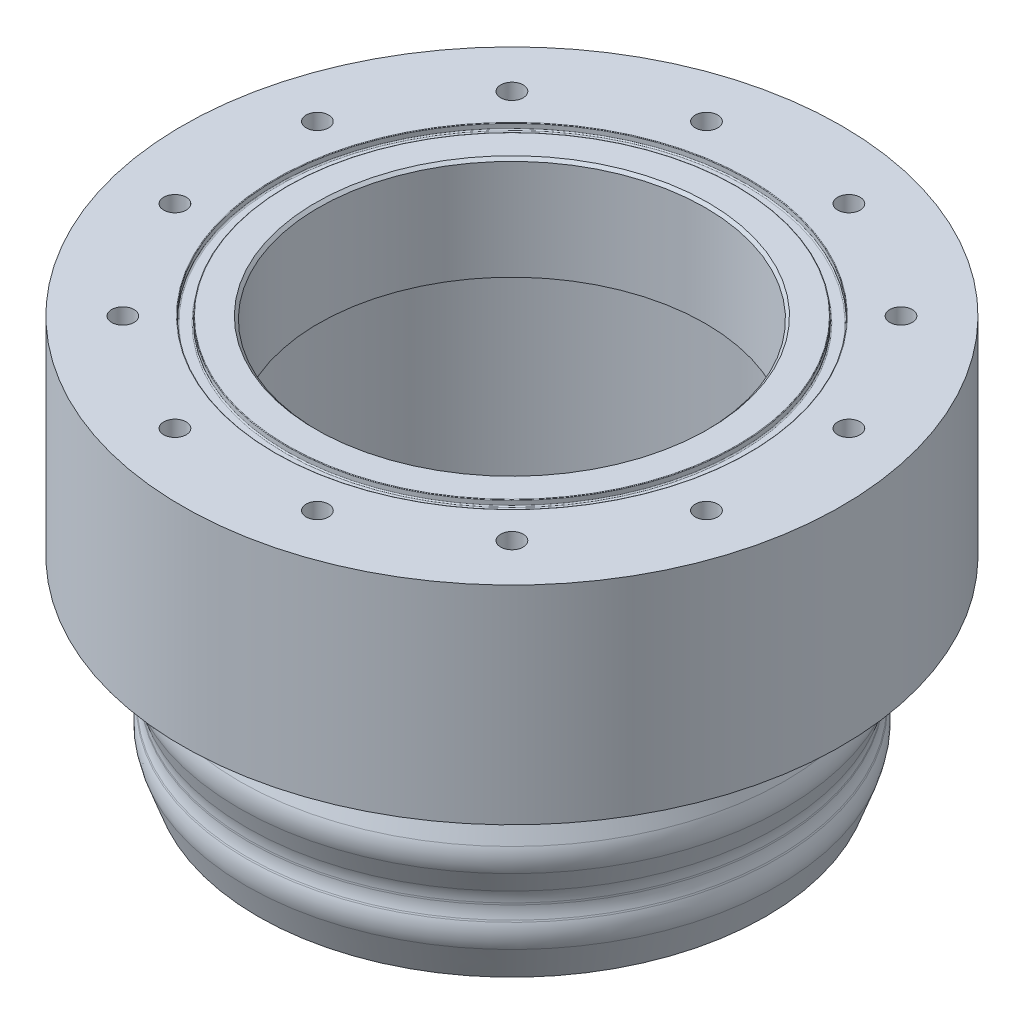
ISO-10303-21;
HEADER;
FILE_DESCRIPTION(('STEP AP214'),'2;1');
FILE_NAME('part.step','',(''),(''),'','','');
FILE_SCHEMA(('AUTOMOTIVE_DESIGN { 1 0 10303 214 1 1 1 1 }'));
ENDSEC;
DATA;
#1=APPLICATION_CONTEXT('core data for automotive mechanical design processes');
#2=APPLICATION_PROTOCOL_DEFINITION('international standard','automotive_design',2000,#1);
#3=PRODUCT_CONTEXT('',#1,'mechanical');
#4=PRODUCT('Part','Part','',(#3));
#5=PRODUCT_RELATED_PRODUCT_CATEGORY('part','',(#4));
#6=PRODUCT_DEFINITION_FORMATION('','',#4);
#7=PRODUCT_DEFINITION_CONTEXT('part definition',#1,'design');
#8=PRODUCT_DEFINITION('design','',#6,#7);
#9=PRODUCT_DEFINITION_SHAPE('','',#8);
#10=(LENGTH_UNIT() NAMED_UNIT(*) SI_UNIT(.MILLI.,.METRE.));
#11=(NAMED_UNIT(*) PLANE_ANGLE_UNIT() SI_UNIT($,.RADIAN.));
#12=(NAMED_UNIT(*) SI_UNIT($,.STERADIAN.) SOLID_ANGLE_UNIT());
#13=UNCERTAINTY_MEASURE_WITH_UNIT(LENGTH_MEASURE(1.E-05),#10,'distance_accuracy_value','');
#14=(GEOMETRIC_REPRESENTATION_CONTEXT(3) GLOBAL_UNCERTAINTY_ASSIGNED_CONTEXT((#13)) GLOBAL_UNIT_ASSIGNED_CONTEXT((#10,
#11,#12)) REPRESENTATION_CONTEXT('',''));
#15=CARTESIAN_POINT('',(0.,0.,0.));
#16=DIRECTION('',(0.,0.,1.));
#17=DIRECTION('',(1.,0.,0.));
#18=AXIS2_PLACEMENT_3D('',#15,#16,#17);
#19=CARTESIAN_POINT('',(0.,0.,0.));
#20=DIRECTION('',(0.,-1.,0.));
#21=DIRECTION('',(0.,0.,-1.));
#22=AXIS2_PLACEMENT_3D('',#19,#20,#21);
#23=CYLINDRICAL_SURFACE('',#22,73.025);
#24=CARTESIAN_POINT('',(0.,-23.15125433516,0.));
#25=DIRECTION('',(0.,-1.,0.));
#26=DIRECTION('',(0.,0.,-1.));
#27=AXIS2_PLACEMENT_3D('',#24,#25,#26);
#28=CIRCLE('',#27,73.025);
#29=CARTESIAN_POINT('',(0.,-23.15125433516,-73.025));
#30=VERTEX_POINT('',#29);
#31=EDGE_CURVE('E92',#30,#30,#28,.T.);
#32=ORIENTED_EDGE('',*,*,#31,.F.);
#33=EDGE_LOOP('',(#32));
#34=FACE_BOUND('',#33,.T.);
#35=CARTESIAN_POINT('',(0.,22.86,0.));
#36=DIRECTION('',(0.,-1.,0.));
#37=DIRECTION('',(0.,0.,-1.));
#38=AXIS2_PLACEMENT_3D('',#35,#36,#37);
#39=CIRCLE('',#38,73.025);
#40=CARTESIAN_POINT('',(0.,22.86,-73.025));
#41=VERTEX_POINT('',#40);
#42=EDGE_CURVE('E128',#41,#41,#39,.T.);
#43=ORIENTED_EDGE('',*,*,#42,.T.);
#44=EDGE_LOOP('',(#43));
#45=FACE_BOUND('',#44,.T.);
#46=ADVANCED_FACE('F36',(#34,#45),#23,.T.);
#47=CARTESIAN_POINT('',(-73.025,-23.15125433516,0.));
#48=DIRECTION('',(0.,1.,0.));
#49=DIRECTION('',(0.,0.,1.));
#50=AXIS2_PLACEMENT_3D('',#47,#48,#49);
#51=PLANE('',#50);
#52=CARTESIAN_POINT('',(0.,-23.15125433516,0.));
#53=DIRECTION('',(0.,1.,0.));
#54=DIRECTION('',(0.,0.,1.));
#55=AXIS2_PLACEMENT_3D('',#52,#53,#54);
#56=CIRCLE('',#55,60.8076);
#57=CARTESIAN_POINT('',(0.,-23.15125433516,60.8076));
#58=VERTEX_POINT('',#57);
#59=EDGE_CURVE('E74',#58,#58,#56,.T.);
#60=ORIENTED_EDGE('',*,*,#59,.T.);
#61=EDGE_LOOP('',(#60));
#62=FACE_BOUND('',#61,.T.);
#63=ORIENTED_EDGE('',*,*,#31,.T.);
#64=EDGE_LOOP('',(#63));
#65=FACE_BOUND('',#64,.T.);
#66=ADVANCED_FACE('F296',(#62,#65),#51,.F.);
#67=CARTESIAN_POINT('',(0.,0.,0.));
#68=DIRECTION('',(0.,-1.,0.));
#69=DIRECTION('',(0.,0.,-1.));
#70=AXIS2_PLACEMENT_3D('',#67,#68,#69);
#71=CYLINDRICAL_SURFACE('',#70,58.2676);
#72=CARTESIAN_POINT('',(0.,-29.1440772325038,0.));
#73=DIRECTION('',(0.,-1.,0.));
#74=DIRECTION('',(0.,0.,-1.));
#75=AXIS2_PLACEMENT_3D('',#72,#73,#74);
#76=CIRCLE('',#75,58.2676);
#77=CARTESIAN_POINT('',(0.,-29.1440772325038,-58.2676));
#78=VERTEX_POINT('',#77);
#79=EDGE_CURVE('E47',#78,#78,#76,.F.);
#80=ORIENTED_EDGE('',*,*,#79,.T.);
#81=EDGE_LOOP('',(#80));
#82=FACE_BOUND('',#81,.T.);
#83=CARTESIAN_POINT('',(0.,-25.69125433516,0.));
#84=DIRECTION('',(0.,1.,0.));
#85=DIRECTION('',(0.,0.,1.));
#86=AXIS2_PLACEMENT_3D('',#83,#84,#85);
#87=CIRCLE('',#86,58.2676);
#88=CARTESIAN_POINT('',(0.,-25.69125433516,58.2676));
#89=VERTEX_POINT('',#88);
#90=EDGE_CURVE('E77',#89,#89,#87,.F.);
#91=ORIENTED_EDGE('',*,*,#90,.T.);
#92=EDGE_LOOP('',(#91));
#93=FACE_BOUND('',#92,.T.);
#94=ADVANCED_FACE('F302',(#82,#93),#71,.T.);
#95=CARTESIAN_POINT('',(0.,-30.4876888255023,0.));
#96=DIRECTION('',(0.,-1.,0.));
#97=DIRECTION('',(0.,0.,-1.));
#98=AXIS2_PLACEMENT_3D('',#95,#96,#97);
#99=CONICAL_SURFACE('',#98,58.2676,0.349065850398867);
#100=CARTESIAN_POINT('',(0.,-31.7502707246454,0.));
#101=DIRECTION('',(0.,-1.,0.));
#102=DIRECTION('',(0.,0.,-1.));
#103=AXIS2_PLACEMENT_3D('',#100,#101,#102);
#104=CIRCLE('',#103,58.7271422296114);
#105=CARTESIAN_POINT('',(0.,-31.7502707246454,-58.7271422296114));
#106=VERTEX_POINT('',#105);
#107=EDGE_CURVE('E51',#106,#106,#104,.T.);
#108=ORIENTED_EDGE('',*,*,#107,.T.);
#109=EDGE_LOOP('',(#108));
#110=FACE_BOUND('',#109,.T.);
#111=CARTESIAN_POINT('',(0.,-36.2558065078584,0.));
#112=DIRECTION('',(0.,1.,0.));
#113=DIRECTION('',(0.,0.,1.));
#114=AXIS2_PLACEMENT_3D('',#111,#112,#113);
#115=CIRCLE('',#114,60.3670231441222);
#116=CARTESIAN_POINT('',(0.,-36.2558065078584,60.3670231441222));
#117=VERTEX_POINT('',#116);
#118=EDGE_CURVE('E86',#117,#117,#115,.T.);
#119=ORIENTED_EDGE('',*,*,#118,.T.);
#120=EDGE_LOOP('',(#119));
#121=FACE_BOUND('',#120,.T.);
#122=ADVANCED_FACE('F343',(#110,#121),#99,.T.);
#123=CARTESIAN_POINT('',(0.,-38.862,0.));
#124=DIRECTION('',(0.,1.,0.));
#125=DIRECTION('',(0.,0.,1.));
#126=AXIS2_PLACEMENT_3D('',#123,#124,#125);
#127=CONICAL_SURFACE('',#126,61.3156,0.349065850398866);
#128=CARTESIAN_POINT('',(0.,-45.9737292753546,0.));
#129=DIRECTION('',(0.,1.,0.));
#130=DIRECTION('',(0.,0.,1.));
#131=AXIS2_PLACEMENT_3D('',#128,#129,#130);
#132=CIRCLE('',#131,58.7271422296114);
#133=CARTESIAN_POINT('',(0.,-45.9737292753546,58.7271422296114));
#134=VERTEX_POINT('',#133);
#135=EDGE_CURVE('E56',#134,#134,#132,.T.);
#136=ORIENTED_EDGE('',*,*,#135,.T.);
#137=EDGE_LOOP('',(#136));
#138=FACE_BOUND('',#137,.T.);
#139=CARTESIAN_POINT('',(0.,-41.4681934921416,0.));
#140=DIRECTION('',(0.,-1.,0.));
#141=DIRECTION('',(0.,0.,-1.));
#142=AXIS2_PLACEMENT_3D('',#139,#140,#141);
#143=CIRCLE('',#142,60.3670231441222);
#144=CARTESIAN_POINT('',(0.,-41.4681934921416,-60.3670231441222));
#145=VERTEX_POINT('',#144);
#146=EDGE_CURVE('E89',#145,#145,#143,.T.);
#147=ORIENTED_EDGE('',*,*,#146,.T.);
#148=EDGE_LOOP('',(#147));
#149=FACE_BOUND('',#148,.T.);
#150=ADVANCED_FACE('F346',(#138,#149),#127,.T.);
#151=CARTESIAN_POINT('',(0.,0.,0.));
#152=DIRECTION('',(0.,-1.,0.));
#153=DIRECTION('',(0.,0.,-1.));
#154=AXIS2_PLACEMENT_3D('',#151,#152,#153);
#155=CYLINDRICAL_SURFACE('',#154,58.2676);
#156=CARTESIAN_POINT('',(0.,-48.9660995814992,0.));
#157=DIRECTION('',(0.,-1.,0.));
#158=DIRECTION('',(0.,0.,-1.));
#159=AXIS2_PLACEMENT_3D('',#156,#157,#158);
#160=CIRCLE('',#159,58.2676);
#161=CARTESIAN_POINT('',(0.,-48.9660995814992,-58.2676));
#162=VERTEX_POINT('',#161);
#163=EDGE_CURVE('E59',#162,#162,#160,.F.);
#164=ORIENTED_EDGE('',*,*,#163,.T.);
#165=EDGE_LOOP('',(#164));
#166=FACE_BOUND('',#165,.T.);
#167=CARTESIAN_POINT('',(0.,-48.5799227674962,0.));
#168=DIRECTION('',(0.,-1.,0.));
#169=DIRECTION('',(0.,0.,-1.));
#170=AXIS2_PLACEMENT_3D('',#167,#168,#169);
#171=CIRCLE('',#170,58.2676);
#172=CARTESIAN_POINT('',(0.,-48.5799227674962,-58.2676));
#173=VERTEX_POINT('',#172);
#174=EDGE_CURVE('E62',#173,#173,#171,.T.);
#175=ORIENTED_EDGE('',*,*,#174,.T.);
#176=EDGE_LOOP('',(#175));
#177=FACE_BOUND('',#176,.T.);
#178=ADVANCED_FACE('F353',(#166,#177),#155,.T.);
#179=CARTESIAN_POINT('',(0.,-50.3097111744977,0.));
#180=DIRECTION('',(0.,-1.,0.));
#181=DIRECTION('',(0.,0.,-1.));
#182=AXIS2_PLACEMENT_3D('',#179,#180,#181);
#183=CONICAL_SURFACE('',#182,58.2676,0.349065850398869);
#184=CARTESIAN_POINT('',(0.,-51.5722930736408,0.));
#185=DIRECTION('',(0.,-1.,0.));
#186=DIRECTION('',(0.,0.,-1.));
#187=AXIS2_PLACEMENT_3D('',#184,#185,#186);
#188=CIRCLE('',#187,58.7271422296114);
#189=CARTESIAN_POINT('',(0.,-51.5722930736408,-58.7271422296114));
#190=VERTEX_POINT('',#189);
#191=EDGE_CURVE('E65',#190,#190,#188,.T.);
#192=ORIENTED_EDGE('',*,*,#191,.T.);
#193=EDGE_LOOP('',(#192));
#194=FACE_BOUND('',#193,.T.);
#195=CARTESIAN_POINT('',(0.,-51.8906732696049,0.));
#196=DIRECTION('',(0.,1.,0.));
#197=DIRECTION('',(0.,0.,1.));
#198=AXIS2_PLACEMENT_3D('',#195,#196,#197);
#199=CIRCLE('',#198,58.8430231441222);
#200=CARTESIAN_POINT('',(0.,-51.8906732696049,58.8430231441222));
#201=VERTEX_POINT('',#200);
#202=EDGE_CURVE('E68',#201,#201,#199,.T.);
#203=ORIENTED_EDGE('',*,*,#202,.T.);
#204=EDGE_LOOP('',(#203));
#205=FACE_BOUND('',#204,.T.);
#206=ADVANCED_FACE('F359',(#194,#205),#183,.T.);
#207=CARTESIAN_POINT('',(0.,-54.4968667617465,0.));
#208=DIRECTION('',(0.,1.,0.));
#209=DIRECTION('',(0.,0.,1.));
#210=AXIS2_PLACEMENT_3D('',#207,#208,#209);
#211=CONICAL_SURFACE('',#210,59.7916,0.349065850398868);
#212=CARTESIAN_POINT('',(0.,-57.1030602538881,0.));
#213=DIRECTION('',(0.,-1.,0.));
#214=DIRECTION('',(0.,0.,-1.));
#215=AXIS2_PLACEMENT_3D('',#212,#213,#214);
#216=CIRCLE('',#215,58.8430231441222);
#217=CARTESIAN_POINT('',(0.,-57.1030602538881,-58.8430231441222));
#218=VERTEX_POINT('',#217);
#219=EDGE_CURVE('E71',#218,#218,#216,.T.);
#220=ORIENTED_EDGE('',*,*,#219,.T.);
#221=EDGE_LOOP('',(#220));
#222=FACE_BOUND('',#221,.T.);
#223=CARTESIAN_POINT('',(0.,-64.2668964653271,0.));
#224=DIRECTION('',(0.,-1.,0.));
#225=DIRECTION('',(0.,0.,-1.));
#226=AXIS2_PLACEMENT_3D('',#223,#224,#225);
#227=CIRCLE('',#226,56.2356);
#228=CARTESIAN_POINT('',(0.,-64.2668964653271,-56.2356));
#229=VERTEX_POINT('',#228);
#230=EDGE_CURVE('E95',#229,#229,#227,.T.);
#231=ORIENTED_EDGE('',*,*,#230,.F.);
#232=EDGE_LOOP('',(#231));
#233=FACE_BOUND('',#232,.T.);
#234=ADVANCED_FACE('F396',(#222,#233),#211,.T.);
#235=CARTESIAN_POINT('',(-56.2356,-64.2668964653271,0.));
#236=DIRECTION('',(0.,1.,0.));
#237=DIRECTION('',(0.,0.,1.));
#238=AXIS2_PLACEMENT_3D('',#235,#236,#237);
#239=PLANE('',#238);
#240=CARTESIAN_POINT('',(0.,-64.2668964653271,0.));
#241=DIRECTION('',(0.,-1.,0.));
#242=DIRECTION('',(0.,0.,-1.));
#243=AXIS2_PLACEMENT_3D('',#240,#241,#242);
#244=CIRCLE('',#243,55.7276);
#245=CARTESIAN_POINT('',(0.,-64.2668964653271,-55.7276));
#246=VERTEX_POINT('',#245);
#247=EDGE_CURVE('E98',#246,#246,#244,.T.);
#248=ORIENTED_EDGE('',*,*,#247,.F.);
#249=EDGE_LOOP('',(#248));
#250=FACE_BOUND('',#249,.T.);
#251=ORIENTED_EDGE('',*,*,#230,.T.);
#252=EDGE_LOOP('',(#251));
#253=FACE_BOUND('',#252,.T.);
#254=ADVANCED_FACE('F730',(#250,#253),#239,.F.);
#255=CARTESIAN_POINT('',(0.,0.,0.));
#256=DIRECTION('',(0.,-1.,0.));
#257=DIRECTION('',(0.,0.,-1.));
#258=AXIS2_PLACEMENT_3D('',#255,#256,#257);
#259=CYLINDRICAL_SURFACE('',#258,55.7276);
#260=CARTESIAN_POINT('',(0.,-2.54,0.));
#261=DIRECTION('',(0.,1.,0.));
#262=DIRECTION('',(0.,0.,1.));
#263=AXIS2_PLACEMENT_3D('',#260,#261,#262);
#264=CIRCLE('',#263,55.7276);
#265=CARTESIAN_POINT('',(0.,-2.54,55.7276));
#266=VERTEX_POINT('',#265);
#267=EDGE_CURVE('E80',#266,#266,#264,.T.);
#268=ORIENTED_EDGE('',*,*,#267,.T.);
#269=EDGE_LOOP('',(#268));
#270=FACE_BOUND('',#269,.T.);
#271=ORIENTED_EDGE('',*,*,#247,.T.);
#272=EDGE_LOOP('',(#271));
#273=FACE_BOUND('',#272,.T.);
#274=ADVANCED_FACE('F740',(#270,#273),#259,.F.);
#275=CARTESIAN_POINT('',(-42.8625,0.,0.));
#276=DIRECTION('',(0.,1.,0.));
#277=DIRECTION('',(0.,0.,1.));
#278=AXIS2_PLACEMENT_3D('',#275,#276,#277);
#279=PLANE('',#278);
#280=CARTESIAN_POINT('',(0.,0.,0.));
#281=DIRECTION('',(0.,1.,0.));
#282=DIRECTION('',(0.,0.,1.));
#283=AXIS2_PLACEMENT_3D('',#280,#281,#282);
#284=CIRCLE('',#283,53.1876);
#285=CARTESIAN_POINT('',(0.,0.,53.1876));
#286=VERTEX_POINT('',#285);
#287=EDGE_CURVE('E83',#286,#286,#284,.F.);
#288=ORIENTED_EDGE('',*,*,#287,.T.);
#289=EDGE_LOOP('',(#288));
#290=FACE_BOUND('',#289,.T.);
#291=CARTESIAN_POINT('',(0.,0.,0.));
#292=DIRECTION('',(0.,-1.,0.));
#293=DIRECTION('',(0.,0.,-1.));
#294=AXIS2_PLACEMENT_3D('',#291,#292,#293);
#295=CIRCLE('',#294,42.8625);
#296=CARTESIAN_POINT('',(0.,0.,-42.8625));
#297=VERTEX_POINT('',#296);
#298=EDGE_CURVE('E101',#297,#297,#295,.T.);
#299=ORIENTED_EDGE('',*,*,#298,.F.);
#300=EDGE_LOOP('',(#299));
#301=FACE_BOUND('',#300,.T.);
#302=ADVANCED_FACE('F293',(#290,#301),#279,.F.);
#303=CARTESIAN_POINT('',(0.,0.,0.));
#304=DIRECTION('',(0.,-1.,0.));
#305=DIRECTION('',(0.,0.,-1.));
#306=AXIS2_PLACEMENT_3D('',#303,#304,#305);
#307=CYLINDRICAL_SURFACE('',#306,42.8625);
#308=CARTESIAN_POINT('',(0.,22.225,0.));
#309=DIRECTION('',(0.,-1.,0.));
#310=DIRECTION('',(0.,0.,-1.));
#311=AXIS2_PLACEMENT_3D('',#308,#309,#310);
#312=CIRCLE('',#311,42.8625);
#313=CARTESIAN_POINT('',(0.,22.225,-42.8625));
#314=VERTEX_POINT('',#313);
#315=EDGE_CURVE('E10',#314,#314,#312,.F.);
#316=ORIENTED_EDGE('',*,*,#315,.T.);
#317=EDGE_LOOP('',(#316));
#318=FACE_BOUND('',#317,.T.);
#319=ORIENTED_EDGE('',*,*,#298,.T.);
#320=EDGE_LOOP('',(#319));
#321=FACE_BOUND('',#320,.T.);
#322=ADVANCED_FACE('F288',(#318,#321),#307,.F.);
#323=CARTESIAN_POINT('',(-42.8625,22.86,0.));
#324=DIRECTION('',(0.,-1.,0.));
#325=DIRECTION('',(0.,0.,-1.));
#326=AXIS2_PLACEMENT_3D('',#323,#324,#325);
#327=PLANE('',#326);
#328=CARTESIAN_POINT('',(0.,22.86,0.));
#329=DIRECTION('',(0.,-1.,0.));
#330=DIRECTION('',(0.,0.,-1.));
#331=AXIS2_PLACEMENT_3D('',#328,#329,#330);
#332=CIRCLE('',#331,43.4975);
#333=CARTESIAN_POINT('',(0.,22.86,-43.4975));
#334=VERTEX_POINT('',#333);
#335=EDGE_CURVE('E43',#334,#334,#332,.T.);
#336=ORIENTED_EDGE('',*,*,#335,.T.);
#337=EDGE_LOOP('',(#336));
#338=FACE_BOUND('',#337,.T.);
#339=CARTESIAN_POINT('',(0.,22.86,0.));
#340=DIRECTION('',(0.,-1.,0.));
#341=DIRECTION('',(0.,0.,-1.));
#342=AXIS2_PLACEMENT_3D('',#339,#340,#341);
#343=CIRCLE('',#342,49.7459);
#344=CARTESIAN_POINT('',(0.,22.86,-49.7459));
#345=VERTEX_POINT('',#344);
#346=EDGE_CURVE('E104',#345,#345,#343,.T.);
#347=ORIENTED_EDGE('',*,*,#346,.F.);
#348=EDGE_LOOP('',(#347));
#349=FACE_BOUND('',#348,.T.);
#350=ADVANCED_FACE('F283',(#338,#349),#327,.F.);
#351=CARTESIAN_POINT('',(0.,22.733,0.));
#352=DIRECTION('',(0.,-1.,0.));
#353=DIRECTION('',(0.,0.,-1.));
#354=AXIS2_PLACEMENT_3D('',#351,#352,#353);
#355=TOROIDAL_SURFACE('',#354,49.7459,0.127);
#356=CARTESIAN_POINT('',(0.,22.733,0.));
#357=DIRECTION('',(0.,-1.,0.));
#358=DIRECTION('',(0.,0.,-1.));
#359=AXIS2_PLACEMENT_3D('',#356,#357,#358);
#360=CIRCLE('',#359,49.8729);
#361=CARTESIAN_POINT('',(0.,22.733,-49.8729));
#362=VERTEX_POINT('',#361);
#363=EDGE_CURVE('E107',#362,#362,#360,.T.);
#364=ORIENTED_EDGE('',*,*,#363,.F.);
#365=EDGE_LOOP('',(#364));
#366=FACE_BOUND('',#365,.T.);
#367=ORIENTED_EDGE('',*,*,#346,.T.);
#368=EDGE_LOOP('',(#367));
#369=FACE_BOUND('',#368,.T.);
#370=ADVANCED_FACE('F277',(#366,#369),#355,.T.);
#371=CARTESIAN_POINT('',(0.,0.,0.));
#372=DIRECTION('',(0.,-1.,0.));
#373=DIRECTION('',(0.,0.,-1.));
#374=AXIS2_PLACEMENT_3D('',#371,#372,#373);
#375=CYLINDRICAL_SURFACE('',#374,49.8729);
#376=CARTESIAN_POINT('',(0.,21.7932,0.));
#377=DIRECTION('',(0.,-1.,0.));
#378=DIRECTION('',(0.,0.,-1.));
#379=AXIS2_PLACEMENT_3D('',#376,#377,#378);
#380=CIRCLE('',#379,49.8729);
#381=CARTESIAN_POINT('',(0.,21.7932,-49.8729));
#382=VERTEX_POINT('',#381);
#383=EDGE_CURVE('E110',#382,#382,#380,.T.);
#384=ORIENTED_EDGE('',*,*,#383,.F.);
#385=EDGE_LOOP('',(#384));
#386=FACE_BOUND('',#385,.T.);
#387=ORIENTED_EDGE('',*,*,#363,.T.);
#388=EDGE_LOOP('',(#387));
#389=FACE_BOUND('',#388,.T.);
#390=ADVANCED_FACE('F271',(#386,#389),#375,.T.);
#391=CARTESIAN_POINT('',(0.,21.7932,0.));
#392=DIRECTION('',(0.,-1.,0.));
#393=DIRECTION('',(0.,0.,-1.));
#394=AXIS2_PLACEMENT_3D('',#391,#392,#393);
#395=TOROIDAL_SURFACE('',#394,50.1269,0.253999999999999);
#396=CARTESIAN_POINT('',(0.,21.5392,0.));
#397=DIRECTION('',(0.,-1.,0.));
#398=DIRECTION('',(0.,0.,-1.));
#399=AXIS2_PLACEMENT_3D('',#396,#397,#398);
#400=CIRCLE('',#399,50.1269);
#401=CARTESIAN_POINT('',(0.,21.5392,-50.1269));
#402=VERTEX_POINT('',#401);
#403=EDGE_CURVE('E113',#402,#402,#400,.T.);
#404=ORIENTED_EDGE('',*,*,#403,.F.);
#405=EDGE_LOOP('',(#404));
#406=FACE_BOUND('',#405,.T.);
#407=ORIENTED_EDGE('',*,*,#383,.T.);
#408=EDGE_LOOP('',(#407));
#409=FACE_BOUND('',#408,.T.);
#410=ADVANCED_FACE('F265',(#406,#409),#395,.F.);
#411=CARTESIAN_POINT('',(-52.1843,21.5392,0.));
#412=DIRECTION('',(0.,-1.,0.));
#413=DIRECTION('',(0.,0.,-1.));
#414=AXIS2_PLACEMENT_3D('',#411,#412,#413);
#415=PLANE('',#414);
#416=CARTESIAN_POINT('',(0.,21.5392,0.));
#417=DIRECTION('',(0.,-1.,0.));
#418=DIRECTION('',(0.,0.,-1.));
#419=AXIS2_PLACEMENT_3D('',#416,#417,#418);
#420=CIRCLE('',#419,52.1843);
#421=CARTESIAN_POINT('',(0.,21.5392,-52.1843));
#422=VERTEX_POINT('',#421);
#423=EDGE_CURVE('E116',#422,#422,#420,.T.);
#424=ORIENTED_EDGE('',*,*,#423,.F.);
#425=EDGE_LOOP('',(#424));
#426=FACE_BOUND('',#425,.T.);
#427=ORIENTED_EDGE('',*,*,#403,.T.);
#428=EDGE_LOOP('',(#427));
#429=FACE_BOUND('',#428,.T.);
#430=ADVANCED_FACE('F259',(#426,#429),#415,.F.);
#431=CARTESIAN_POINT('',(0.,21.7932,0.));
#432=DIRECTION('',(0.,-1.,0.));
#433=DIRECTION('',(0.,0.,-1.));
#434=AXIS2_PLACEMENT_3D('',#431,#432,#433);
#435=TOROIDAL_SURFACE('',#434,52.1843,0.253999999999999);
#436=CARTESIAN_POINT('',(0.,21.7932,0.));
#437=DIRECTION('',(0.,-1.,0.));
#438=DIRECTION('',(0.,0.,-1.));
#439=AXIS2_PLACEMENT_3D('',#436,#437,#438);
#440=CIRCLE('',#439,52.4383);
#441=CARTESIAN_POINT('',(0.,21.7932,-52.4383));
#442=VERTEX_POINT('',#441);
#443=EDGE_CURVE('E119',#442,#442,#440,.T.);
#444=ORIENTED_EDGE('',*,*,#443,.F.);
#445=EDGE_LOOP('',(#444));
#446=FACE_BOUND('',#445,.T.);
#447=ORIENTED_EDGE('',*,*,#423,.T.);
#448=EDGE_LOOP('',(#447));
#449=FACE_BOUND('',#448,.T.);
#450=ADVANCED_FACE('F253',(#446,#449),#435,.F.);
#451=CARTESIAN_POINT('',(0.,0.,0.));
#452=DIRECTION('',(0.,-1.,0.));
#453=DIRECTION('',(0.,0.,-1.));
#454=AXIS2_PLACEMENT_3D('',#451,#452,#453);
#455=CYLINDRICAL_SURFACE('',#454,52.4383);
#456=CARTESIAN_POINT('',(0.,22.733,0.));
#457=DIRECTION('',(0.,-1.,0.));
#458=DIRECTION('',(0.,0.,-1.));
#459=AXIS2_PLACEMENT_3D('',#456,#457,#458);
#460=CIRCLE('',#459,52.4383);
#461=CARTESIAN_POINT('',(0.,22.733,-52.4383));
#462=VERTEX_POINT('',#461);
#463=EDGE_CURVE('E122',#462,#462,#460,.T.);
#464=ORIENTED_EDGE('',*,*,#463,.F.);
#465=EDGE_LOOP('',(#464));
#466=FACE_BOUND('',#465,.T.);
#467=ORIENTED_EDGE('',*,*,#443,.T.);
#468=EDGE_LOOP('',(#467));
#469=FACE_BOUND('',#468,.T.);
#470=ADVANCED_FACE('F247',(#466,#469),#455,.F.);
#471=CARTESIAN_POINT('',(0.,22.733,0.));
#472=DIRECTION('',(0.,-1.,0.));
#473=DIRECTION('',(0.,0.,-1.));
#474=AXIS2_PLACEMENT_3D('',#471,#472,#473);
#475=TOROIDAL_SURFACE('',#474,52.5653,0.127);
#476=CARTESIAN_POINT('',(0.,22.86,0.));
#477=DIRECTION('',(0.,-1.,0.));
#478=DIRECTION('',(0.,0.,-1.));
#479=AXIS2_PLACEMENT_3D('',#476,#477,#478);
#480=CIRCLE('',#479,52.5653);
#481=CARTESIAN_POINT('',(0.,22.86,-52.5653));
#482=VERTEX_POINT('',#481);
#483=EDGE_CURVE('E125',#482,#482,#480,.T.);
#484=ORIENTED_EDGE('',*,*,#483,.F.);
#485=EDGE_LOOP('',(#484));
#486=FACE_BOUND('',#485,.T.);
#487=ORIENTED_EDGE('',*,*,#463,.T.);
#488=EDGE_LOOP('',(#487));
#489=FACE_BOUND('',#488,.T.);
#490=ADVANCED_FACE('F217',(#486,#489),#475,.T.);
#491=CARTESIAN_POINT('',(-73.025,22.86,0.));
#492=DIRECTION('',(0.,-1.,0.));
#493=DIRECTION('',(0.,0.,-1.));
#494=AXIS2_PLACEMENT_3D('',#491,#492,#493);
#495=PLANE('',#494);
#496=CARTESIAN_POINT('',(-58.8828383705818,22.86,15.7776089894489));
#497=DIRECTION('',(0.,1.,0.));
#498=DIRECTION('',(0.499999999999989,0.,0.866025403784445));
#499=AXIS2_PLACEMENT_3D('',#496,#497,#498);
#500=CIRCLE('',#499,2.4892);
#501=CARTESIAN_POINT('',(-57.6382383705818,22.86,17.9333194245491));
#502=VERTEX_POINT('',#501);
#503=EDGE_CURVE('E198',#502,#502,#500,.T.);
#504=ORIENTED_EDGE('',*,*,#503,.F.);
#505=EDGE_LOOP('',(#504));
#506=FACE_BOUND('',#505,.T.);
#507=CARTESIAN_POINT('',(-43.1052293811325,22.86,43.1052293811314));
#508=DIRECTION('',(0.,1.,0.));
#509=DIRECTION('',(0.866025403784433,0.,0.50000000000001));
#510=AXIS2_PLACEMENT_3D('',#507,#508,#509);
#511=CIRCLE('',#510,2.4892);
#512=CARTESIAN_POINT('',(-40.9495189460323,22.86,44.3498293811314));
#513=VERTEX_POINT('',#512);
#514=EDGE_CURVE('E192',#513,#513,#511,.T.);
#515=ORIENTED_EDGE('',*,*,#514,.F.);
#516=EDGE_LOOP('',(#515));
#517=FACE_BOUND('',#516,.T.);
#518=CARTESIAN_POINT('',(-15.7776089894503,22.86,58.8828383705814));
#519=DIRECTION('',(0.,1.,0.));
#520=DIRECTION('',(1.,0.,0.));
#521=AXIS2_PLACEMENT_3D('',#518,#519,#520);
#522=CIRCLE('',#521,2.4892);
#523=CARTESIAN_POINT('',(-13.2884089894503,22.86,58.8828383705815));
#524=VERTEX_POINT('',#523);
#525=EDGE_CURVE('E186',#524,#524,#522,.T.);
#526=ORIENTED_EDGE('',*,*,#525,.F.);
#527=EDGE_LOOP('',(#526));
#528=FACE_BOUND('',#527,.T.);
#529=CARTESIAN_POINT('',(15.7776089894491,22.86,58.8828383705818));
#530=DIRECTION('',(0.,1.,0.));
#531=DIRECTION('',(0.866025403784443,0.,-0.499999999999992));
#532=AXIS2_PLACEMENT_3D('',#529,#530,#531);
#533=CIRCLE('',#532,2.4892);
#534=CARTESIAN_POINT('',(17.9333194245493,22.86,57.6382383705818));
#535=VERTEX_POINT('',#534);
#536=EDGE_CURVE('E180',#535,#535,#533,.T.);
#537=ORIENTED_EDGE('',*,*,#536,.F.);
#538=EDGE_LOOP('',(#537));
#539=FACE_BOUND('',#538,.T.);
#540=CARTESIAN_POINT('',(43.1052293811316,22.86,43.1052293811323));
#541=DIRECTION('',(0.,1.,0.));
#542=DIRECTION('',(0.500000000000007,0.,-0.866025403784435));
#543=AXIS2_PLACEMENT_3D('',#540,#541,#542);
#544=CIRCLE('',#543,2.4892);
#545=CARTESIAN_POINT('',(44.3498293811316,22.86,40.9495189460321));
#546=VERTEX_POINT('',#545);
#547=EDGE_CURVE('E174',#546,#546,#544,.T.);
#548=ORIENTED_EDGE('',*,*,#547,.F.);
#549=EDGE_LOOP('',(#548));
#550=FACE_BOUND('',#549,.T.);
#551=CARTESIAN_POINT('',(58.8828383705815,22.86,15.7776089894501));
#552=DIRECTION('',(0.,1.,0.));
#553=DIRECTION('',(0.,0.,-1.));
#554=AXIS2_PLACEMENT_3D('',#551,#552,#553);
#555=CIRCLE('',#554,2.4892);
#556=CARTESIAN_POINT('',(58.8828383705815,22.86,13.2884089894501));
#557=VERTEX_POINT('',#556);
#558=EDGE_CURVE('E168',#557,#557,#555,.T.);
#559=ORIENTED_EDGE('',*,*,#558,.F.);
#560=EDGE_LOOP('',(#559));
#561=FACE_BOUND('',#560,.T.);
#562=CARTESIAN_POINT('',(58.8828383705817,22.86,-15.7776089894493));
#563=DIRECTION('',(0.,1.,0.));
#564=DIRECTION('',(-0.499999999999995,0.,-0.866025403784442));
#565=AXIS2_PLACEMENT_3D('',#562,#563,#564);
#566=CIRCLE('',#565,2.4892);
#567=CARTESIAN_POINT('',(57.6382383705817,22.86,-17.9333194245495));
#568=VERTEX_POINT('',#567);
#569=EDGE_CURVE('E162',#568,#568,#566,.T.);
#570=ORIENTED_EDGE('',*,*,#569,.F.);
#571=EDGE_LOOP('',(#570));
#572=FACE_BOUND('',#571,.T.);
#573=CARTESIAN_POINT('',(43.1052293811322,22.86,-43.1052293811317));
#574=DIRECTION('',(0.,1.,0.));
#575=DIRECTION('',(-0.866025403784436,0.,-0.500000000000004));
#576=AXIS2_PLACEMENT_3D('',#573,#574,#575);
#577=CIRCLE('',#576,2.4892);
#578=CARTESIAN_POINT('',(40.949518946032,22.86,-44.3498293811317));
#579=VERTEX_POINT('',#578);
#580=EDGE_CURVE('E156',#579,#579,#577,.T.);
#581=ORIENTED_EDGE('',*,*,#580,.F.);
#582=EDGE_LOOP('',(#581));
#583=FACE_BOUND('',#582,.T.);
#584=CARTESIAN_POINT('',(15.7776089894499,22.86,-58.8828383705815));
#585=DIRECTION('',(0.,1.,0.));
#586=DIRECTION('',(-1.,0.,0.));
#587=AXIS2_PLACEMENT_3D('',#584,#585,#586);
#588=CIRCLE('',#587,2.4892);
#589=CARTESIAN_POINT('',(13.2884089894499,22.86,-58.8828383705815));
#590=VERTEX_POINT('',#589);
#591=EDGE_CURVE('E150',#590,#590,#588,.T.);
#592=ORIENTED_EDGE('',*,*,#591,.F.);
#593=EDGE_LOOP('',(#592));
#594=FACE_BOUND('',#593,.T.);
#595=CARTESIAN_POINT('',(-15.7776089894495,22.86,-58.8828383705817));
#596=DIRECTION('',(0.,1.,0.));
#597=DIRECTION('',(-0.86602540378444,0.,0.499999999999998));
#598=AXIS2_PLACEMENT_3D('',#595,#596,#597);
#599=CIRCLE('',#598,2.4892);
#600=CARTESIAN_POINT('',(-17.9333194245497,22.86,-57.6382383705817));
#601=VERTEX_POINT('',#600);
#602=EDGE_CURVE('E144',#601,#601,#599,.T.);
#603=ORIENTED_EDGE('',*,*,#602,.F.);
#604=EDGE_LOOP('',(#603));
#605=FACE_BOUND('',#604,.T.);
#606=CARTESIAN_POINT('',(-43.1052293811319,22.86,-43.105229381132));
#607=DIRECTION('',(0.,1.,0.));
#608=DIRECTION('',(-0.500000000000001,0.,0.866025403784438));
#609=AXIS2_PLACEMENT_3D('',#606,#607,#608);
#610=CIRCLE('',#609,2.4892);
#611=CARTESIAN_POINT('',(-44.3498293811319,22.86,-40.9495189460318));
#612=VERTEX_POINT('',#611);
#613=EDGE_CURVE('E138',#612,#612,#610,.T.);
#614=ORIENTED_EDGE('',*,*,#613,.F.);
#615=EDGE_LOOP('',(#614));
#616=FACE_BOUND('',#615,.T.);
#617=CARTESIAN_POINT('',(-58.8828383705816,22.86,-15.7776089894497));
#618=DIRECTION('',(0.,1.,0.));
#619=DIRECTION('',(0.,0.,1.));
#620=AXIS2_PLACEMENT_3D('',#617,#618,#619);
#621=CIRCLE('',#620,2.4892);
#622=CARTESIAN_POINT('',(-58.8828383705816,22.86,-13.2884089894497));
#623=VERTEX_POINT('',#622);
#624=EDGE_CURVE('E132',#623,#623,#621,.T.);
#625=ORIENTED_EDGE('',*,*,#624,.F.);
#626=EDGE_LOOP('',(#625));
#627=FACE_BOUND('',#626,.T.);
#628=ORIENTED_EDGE('',*,*,#42,.F.);
#629=EDGE_LOOP('',(#628));
#630=FACE_BOUND('',#629,.T.);
#631=ORIENTED_EDGE('',*,*,#483,.T.);
#632=EDGE_LOOP('',(#631));
#633=FACE_BOUND('',#632,.T.);
#634=ADVANCED_FACE('F213',(#506,#517,#528,#539,#550,#561,#572,#583,#594,#605,#616,#627,#630,
#633),#495,.F.);
#635=CARTESIAN_POINT('',(-58.8828383705816,1.26999999999999,-15.7776089894497));
#636=DIRECTION('',(0.,1.,0.));
#637=DIRECTION('',(0.,0.,1.));
#638=AXIS2_PLACEMENT_3D('',#635,#636,#637);
#639=CYLINDRICAL_SURFACE('',#638,2.4892);
#640=CARTESIAN_POINT('',(-58.8828383705816,1.26999999999999,-15.7776089894497));
#641=DIRECTION('',(0.,1.,0.));
#642=DIRECTION('',(0.,0.,1.));
#643=AXIS2_PLACEMENT_3D('',#640,#641,#642);
#644=CIRCLE('',#643,2.4892);
#645=CARTESIAN_POINT('',(-58.8828383705816,1.26999999999999,-13.2884089894497));
#646=VERTEX_POINT('',#645);
#647=EDGE_CURVE('E131',#646,#646,#644,.T.);
#648=ORIENTED_EDGE('',*,*,#647,.F.);
#649=EDGE_LOOP('',(#648));
#650=FACE_BOUND('',#649,.T.);
#651=ORIENTED_EDGE('',*,*,#624,.T.);
#652=EDGE_LOOP('',(#651));
#653=FACE_BOUND('',#652,.T.);
#654=ADVANCED_FACE('F216',(#650,#653),#639,.F.);
#655=CARTESIAN_POINT('',(-58.8828383705816,1.26999999999999,-15.7776089894497));
#656=DIRECTION('',(0.,1.,0.));
#657=DIRECTION('',(0.,0.,1.));
#658=AXIS2_PLACEMENT_3D('',#655,#656,#657);
#659=PLANE('',#658);
#660=ORIENTED_EDGE('',*,*,#647,.T.);
#661=EDGE_LOOP('',(#660));
#662=FACE_BOUND('',#661,.T.);
#663=ADVANCED_FACE('F486',(#662),#659,.T.);
#664=CARTESIAN_POINT('',(-43.1052293811319,1.26999999999999,-43.105229381132));
#665=DIRECTION('',(0.,1.,0.));
#666=DIRECTION('',(0.,0.,1.));
#667=AXIS2_PLACEMENT_3D('',#664,#665,#666);
#668=CYLINDRICAL_SURFACE('',#667,2.4892);
#669=CARTESIAN_POINT('',(-43.1052293811319,1.26999999999999,-43.105229381132));
#670=DIRECTION('',(0.,1.,0.));
#671=DIRECTION('',(-0.500000000000001,0.,0.866025403784438));
#672=AXIS2_PLACEMENT_3D('',#669,#670,#671);
#673=CIRCLE('',#672,2.4892);
#674=CARTESIAN_POINT('',(-44.3498293811319,1.26999999999999,-40.9495189460318));
#675=VERTEX_POINT('',#674);
#676=EDGE_CURVE('E135',#675,#675,#673,.T.);
#677=ORIENTED_EDGE('',*,*,#676,.F.);
#678=EDGE_LOOP('',(#677));
#679=FACE_BOUND('',#678,.T.);
#680=ORIENTED_EDGE('',*,*,#613,.T.);
#681=EDGE_LOOP('',(#680));
#682=FACE_BOUND('',#681,.T.);
#683=ADVANCED_FACE('F494',(#679,#682),#668,.F.);
#684=CARTESIAN_POINT('',(-43.1052293811319,1.26999999999999,-43.105229381132));
#685=DIRECTION('',(0.,1.,0.));
#686=DIRECTION('',(-0.500000000000001,0.,0.866025403784438));
#687=AXIS2_PLACEMENT_3D('',#684,#685,#686);
#688=PLANE('',#687);
#689=ORIENTED_EDGE('',*,*,#676,.T.);
#690=EDGE_LOOP('',(#689));
#691=FACE_BOUND('',#690,.T.);
#692=ADVANCED_FACE('F502',(#691),#688,.T.);
#693=CARTESIAN_POINT('',(-15.7776089894495,1.26999999999999,-58.8828383705817));
#694=DIRECTION('',(0.,1.,0.));
#695=DIRECTION('',(0.,0.,1.));
#696=AXIS2_PLACEMENT_3D('',#693,#694,#695);
#697=CYLINDRICAL_SURFACE('',#696,2.4892);
#698=CARTESIAN_POINT('',(-15.7776089894495,1.26999999999999,-58.8828383705817));
#699=DIRECTION('',(0.,1.,0.));
#700=DIRECTION('',(-0.86602540378444,0.,0.499999999999998));
#701=AXIS2_PLACEMENT_3D('',#698,#699,#700);
#702=CIRCLE('',#701,2.4892);
#703=CARTESIAN_POINT('',(-17.9333194245497,1.26999999999999,-57.6382383705817));
#704=VERTEX_POINT('',#703);
#705=EDGE_CURVE('E141',#704,#704,#702,.T.);
#706=ORIENTED_EDGE('',*,*,#705,.F.);
#707=EDGE_LOOP('',(#706));
#708=FACE_BOUND('',#707,.T.);
#709=ORIENTED_EDGE('',*,*,#602,.T.);
#710=EDGE_LOOP('',(#709));
#711=FACE_BOUND('',#710,.T.);
#712=ADVANCED_FACE('F512',(#708,#711),#697,.F.);
#713=CARTESIAN_POINT('',(-15.7776089894495,1.26999999999999,-58.8828383705817));
#714=DIRECTION('',(0.,1.,0.));
#715=DIRECTION('',(-0.86602540378444,0.,0.499999999999998));
#716=AXIS2_PLACEMENT_3D('',#713,#714,#715);
#717=PLANE('',#716);
#718=ORIENTED_EDGE('',*,*,#705,.T.);
#719=EDGE_LOOP('',(#718));
#720=FACE_BOUND('',#719,.T.);
#721=ADVANCED_FACE('F522',(#720),#717,.T.);
#722=CARTESIAN_POINT('',(15.7776089894499,1.26999999999999,-58.8828383705815));
#723=DIRECTION('',(0.,1.,0.));
#724=DIRECTION('',(0.,0.,1.));
#725=AXIS2_PLACEMENT_3D('',#722,#723,#724);
#726=CYLINDRICAL_SURFACE('',#725,2.4892);
#727=CARTESIAN_POINT('',(15.7776089894499,1.26999999999999,-58.8828383705815));
#728=DIRECTION('',(0.,1.,0.));
#729=DIRECTION('',(-1.,0.,0.));
#730=AXIS2_PLACEMENT_3D('',#727,#728,#729);
#731=CIRCLE('',#730,2.4892);
#732=CARTESIAN_POINT('',(13.2884089894499,1.26999999999999,-58.8828383705815));
#733=VERTEX_POINT('',#732);
#734=EDGE_CURVE('E147',#733,#733,#731,.T.);
#735=ORIENTED_EDGE('',*,*,#734,.F.);
#736=EDGE_LOOP('',(#735));
#737=FACE_BOUND('',#736,.T.);
#738=ORIENTED_EDGE('',*,*,#591,.T.);
#739=EDGE_LOOP('',(#738));
#740=FACE_BOUND('',#739,.T.);
#741=ADVANCED_FACE('F532',(#737,#740),#726,.F.);
#742=CARTESIAN_POINT('',(15.7776089894499,1.26999999999999,-58.8828383705815));
#743=DIRECTION('',(0.,1.,0.));
#744=DIRECTION('',(-1.,0.,0.));
#745=AXIS2_PLACEMENT_3D('',#742,#743,#744);
#746=PLANE('',#745);
#747=ORIENTED_EDGE('',*,*,#734,.T.);
#748=EDGE_LOOP('',(#747));
#749=FACE_BOUND('',#748,.T.);
#750=ADVANCED_FACE('F542',(#749),#746,.T.);
#751=CARTESIAN_POINT('',(43.1052293811322,1.26999999999999,-43.1052293811317));
#752=DIRECTION('',(0.,1.,0.));
#753=DIRECTION('',(0.,0.,1.));
#754=AXIS2_PLACEMENT_3D('',#751,#752,#753);
#755=CYLINDRICAL_SURFACE('',#754,2.4892);
#756=CARTESIAN_POINT('',(43.1052293811322,1.26999999999999,-43.1052293811317));
#757=DIRECTION('',(0.,1.,0.));
#758=DIRECTION('',(-0.866025403784436,0.,-0.500000000000004));
#759=AXIS2_PLACEMENT_3D('',#756,#757,#758);
#760=CIRCLE('',#759,2.4892);
#761=CARTESIAN_POINT('',(40.949518946032,1.26999999999999,-44.3498293811317));
#762=VERTEX_POINT('',#761);
#763=EDGE_CURVE('E153',#762,#762,#760,.T.);
#764=ORIENTED_EDGE('',*,*,#763,.F.);
#765=EDGE_LOOP('',(#764));
#766=FACE_BOUND('',#765,.T.);
#767=ORIENTED_EDGE('',*,*,#580,.T.);
#768=EDGE_LOOP('',(#767));
#769=FACE_BOUND('',#768,.T.);
#770=ADVANCED_FACE('F552',(#766,#769),#755,.F.);
#771=CARTESIAN_POINT('',(43.1052293811322,1.26999999999999,-43.1052293811317));
#772=DIRECTION('',(0.,1.,0.));
#773=DIRECTION('',(-0.866025403784436,0.,-0.500000000000004));
#774=AXIS2_PLACEMENT_3D('',#771,#772,#773);
#775=PLANE('',#774);
#776=ORIENTED_EDGE('',*,*,#763,.T.);
#777=EDGE_LOOP('',(#776));
#778=FACE_BOUND('',#777,.T.);
#779=ADVANCED_FACE('F562',(#778),#775,.T.);
#780=CARTESIAN_POINT('',(58.8828383705817,1.26999999999999,-15.7776089894493));
#781=DIRECTION('',(0.,1.,0.));
#782=DIRECTION('',(0.,0.,1.));
#783=AXIS2_PLACEMENT_3D('',#780,#781,#782);
#784=CYLINDRICAL_SURFACE('',#783,2.4892);
#785=CARTESIAN_POINT('',(58.8828383705817,1.26999999999999,-15.7776089894493));
#786=DIRECTION('',(0.,1.,0.));
#787=DIRECTION('',(-0.499999999999995,0.,-0.866025403784442));
#788=AXIS2_PLACEMENT_3D('',#785,#786,#787);
#789=CIRCLE('',#788,2.4892);
#790=CARTESIAN_POINT('',(57.6382383705817,1.26999999999999,-17.9333194245495));
#791=VERTEX_POINT('',#790);
#792=EDGE_CURVE('E159',#791,#791,#789,.T.);
#793=ORIENTED_EDGE('',*,*,#792,.F.);
#794=EDGE_LOOP('',(#793));
#795=FACE_BOUND('',#794,.T.);
#796=ORIENTED_EDGE('',*,*,#569,.T.);
#797=EDGE_LOOP('',(#796));
#798=FACE_BOUND('',#797,.T.);
#799=ADVANCED_FACE('F572',(#795,#798),#784,.F.);
#800=CARTESIAN_POINT('',(58.8828383705817,1.26999999999999,-15.7776089894493));
#801=DIRECTION('',(0.,1.,0.));
#802=DIRECTION('',(-0.499999999999995,0.,-0.866025403784442));
#803=AXIS2_PLACEMENT_3D('',#800,#801,#802);
#804=PLANE('',#803);
#805=ORIENTED_EDGE('',*,*,#792,.T.);
#806=EDGE_LOOP('',(#805));
#807=FACE_BOUND('',#806,.T.);
#808=ADVANCED_FACE('F582',(#807),#804,.T.);
#809=CARTESIAN_POINT('',(58.8828383705815,1.26999999999999,15.7776089894501));
#810=DIRECTION('',(0.,1.,0.));
#811=DIRECTION('',(0.,0.,1.));
#812=AXIS2_PLACEMENT_3D('',#809,#810,#811);
#813=CYLINDRICAL_SURFACE('',#812,2.4892);
#814=CARTESIAN_POINT('',(58.8828383705815,1.26999999999999,15.7776089894501));
#815=DIRECTION('',(0.,1.,0.));
#816=DIRECTION('',(0.,0.,-1.));
#817=AXIS2_PLACEMENT_3D('',#814,#815,#816);
#818=CIRCLE('',#817,2.4892);
#819=CARTESIAN_POINT('',(58.8828383705815,1.26999999999999,13.2884089894501));
#820=VERTEX_POINT('',#819);
#821=EDGE_CURVE('E165',#820,#820,#818,.T.);
#822=ORIENTED_EDGE('',*,*,#821,.F.);
#823=EDGE_LOOP('',(#822));
#824=FACE_BOUND('',#823,.T.);
#825=ORIENTED_EDGE('',*,*,#558,.T.);
#826=EDGE_LOOP('',(#825));
#827=FACE_BOUND('',#826,.T.);
#828=ADVANCED_FACE('F592',(#824,#827),#813,.F.);
#829=CARTESIAN_POINT('',(58.8828383705815,1.26999999999999,15.7776089894501));
#830=DIRECTION('',(0.,1.,0.));
#831=DIRECTION('',(0.,0.,-1.));
#832=AXIS2_PLACEMENT_3D('',#829,#830,#831);
#833=PLANE('',#832);
#834=ORIENTED_EDGE('',*,*,#821,.T.);
#835=EDGE_LOOP('',(#834));
#836=FACE_BOUND('',#835,.T.);
#837=ADVANCED_FACE('F602',(#836),#833,.T.);
#838=CARTESIAN_POINT('',(43.1052293811316,1.26999999999999,43.1052293811323));
#839=DIRECTION('',(0.,1.,0.));
#840=DIRECTION('',(0.,0.,1.));
#841=AXIS2_PLACEMENT_3D('',#838,#839,#840);
#842=CYLINDRICAL_SURFACE('',#841,2.4892);
#843=CARTESIAN_POINT('',(43.1052293811316,1.26999999999999,43.1052293811323));
#844=DIRECTION('',(0.,1.,0.));
#845=DIRECTION('',(0.500000000000007,0.,-0.866025403784435));
#846=AXIS2_PLACEMENT_3D('',#843,#844,#845);
#847=CIRCLE('',#846,2.4892);
#848=CARTESIAN_POINT('',(44.3498293811316,1.26999999999999,40.9495189460321));
#849=VERTEX_POINT('',#848);
#850=EDGE_CURVE('E171',#849,#849,#847,.T.);
#851=ORIENTED_EDGE('',*,*,#850,.F.);
#852=EDGE_LOOP('',(#851));
#853=FACE_BOUND('',#852,.T.);
#854=ORIENTED_EDGE('',*,*,#547,.T.);
#855=EDGE_LOOP('',(#854));
#856=FACE_BOUND('',#855,.T.);
#857=ADVANCED_FACE('F612',(#853,#856),#842,.F.);
#858=CARTESIAN_POINT('',(43.1052293811316,1.26999999999999,43.1052293811323));
#859=DIRECTION('',(0.,1.,0.));
#860=DIRECTION('',(0.500000000000007,0.,-0.866025403784435));
#861=AXIS2_PLACEMENT_3D('',#858,#859,#860);
#862=PLANE('',#861);
#863=ORIENTED_EDGE('',*,*,#850,.T.);
#864=EDGE_LOOP('',(#863));
#865=FACE_BOUND('',#864,.T.);
#866=ADVANCED_FACE('F622',(#865),#862,.T.);
#867=CARTESIAN_POINT('',(15.7776089894491,1.26999999999999,58.8828383705818));
#868=DIRECTION('',(0.,1.,0.));
#869=DIRECTION('',(0.,0.,1.));
#870=AXIS2_PLACEMENT_3D('',#867,#868,#869);
#871=CYLINDRICAL_SURFACE('',#870,2.4892);
#872=CARTESIAN_POINT('',(15.7776089894491,1.26999999999999,58.8828383705818));
#873=DIRECTION('',(0.,1.,0.));
#874=DIRECTION('',(0.866025403784443,0.,-0.499999999999992));
#875=AXIS2_PLACEMENT_3D('',#872,#873,#874);
#876=CIRCLE('',#875,2.4892);
#877=CARTESIAN_POINT('',(17.9333194245493,1.26999999999999,57.6382383705818));
#878=VERTEX_POINT('',#877);
#879=EDGE_CURVE('E177',#878,#878,#876,.T.);
#880=ORIENTED_EDGE('',*,*,#879,.F.);
#881=EDGE_LOOP('',(#880));
#882=FACE_BOUND('',#881,.T.);
#883=ORIENTED_EDGE('',*,*,#536,.T.);
#884=EDGE_LOOP('',(#883));
#885=FACE_BOUND('',#884,.T.);
#886=ADVANCED_FACE('F632',(#882,#885),#871,.F.);
#887=CARTESIAN_POINT('',(15.7776089894491,1.26999999999999,58.8828383705818));
#888=DIRECTION('',(0.,1.,0.));
#889=DIRECTION('',(0.866025403784443,0.,-0.499999999999992));
#890=AXIS2_PLACEMENT_3D('',#887,#888,#889);
#891=PLANE('',#890);
#892=ORIENTED_EDGE('',*,*,#879,.T.);
#893=EDGE_LOOP('',(#892));
#894=FACE_BOUND('',#893,.T.);
#895=ADVANCED_FACE('F642',(#894),#891,.T.);
#896=CARTESIAN_POINT('',(-15.7776089894503,1.26999999999999,58.8828383705814));
#897=DIRECTION('',(0.,1.,0.));
#898=DIRECTION('',(0.,0.,1.));
#899=AXIS2_PLACEMENT_3D('',#896,#897,#898);
#900=CYLINDRICAL_SURFACE('',#899,2.4892);
#901=CARTESIAN_POINT('',(-15.7776089894503,1.26999999999999,58.8828383705814));
#902=DIRECTION('',(0.,1.,0.));
#903=DIRECTION('',(1.,0.,0.));
#904=AXIS2_PLACEMENT_3D('',#901,#902,#903);
#905=CIRCLE('',#904,2.4892);
#906=CARTESIAN_POINT('',(-13.2884089894503,1.26999999999999,58.8828383705815));
#907=VERTEX_POINT('',#906);
#908=EDGE_CURVE('E183',#907,#907,#905,.T.);
#909=ORIENTED_EDGE('',*,*,#908,.F.);
#910=EDGE_LOOP('',(#909));
#911=FACE_BOUND('',#910,.T.);
#912=ORIENTED_EDGE('',*,*,#525,.T.);
#913=EDGE_LOOP('',(#912));
#914=FACE_BOUND('',#913,.T.);
#915=ADVANCED_FACE('F652',(#911,#914),#900,.F.);
#916=CARTESIAN_POINT('',(-15.7776089894503,1.26999999999999,58.8828383705814));
#917=DIRECTION('',(0.,1.,0.));
#918=DIRECTION('',(1.,0.,0.));
#919=AXIS2_PLACEMENT_3D('',#916,#917,#918);
#920=PLANE('',#919);
#921=ORIENTED_EDGE('',*,*,#908,.T.);
#922=EDGE_LOOP('',(#921));
#923=FACE_BOUND('',#922,.T.);
#924=ADVANCED_FACE('F662',(#923),#920,.T.);
#925=CARTESIAN_POINT('',(-43.1052293811325,1.26999999999999,43.1052293811314));
#926=DIRECTION('',(0.,1.,0.));
#927=DIRECTION('',(0.,0.,1.));
#928=AXIS2_PLACEMENT_3D('',#925,#926,#927);
#929=CYLINDRICAL_SURFACE('',#928,2.4892);
#930=CARTESIAN_POINT('',(-43.1052293811325,1.26999999999999,43.1052293811314));
#931=DIRECTION('',(0.,1.,0.));
#932=DIRECTION('',(0.866025403784433,0.,0.50000000000001));
#933=AXIS2_PLACEMENT_3D('',#930,#931,#932);
#934=CIRCLE('',#933,2.4892);
#935=CARTESIAN_POINT('',(-40.9495189460323,1.26999999999999,44.3498293811314));
#936=VERTEX_POINT('',#935);
#937=EDGE_CURVE('E189',#936,#936,#934,.T.);
#938=ORIENTED_EDGE('',*,*,#937,.F.);
#939=EDGE_LOOP('',(#938));
#940=FACE_BOUND('',#939,.T.);
#941=ORIENTED_EDGE('',*,*,#514,.T.);
#942=EDGE_LOOP('',(#941));
#943=FACE_BOUND('',#942,.T.);
#944=ADVANCED_FACE('F672',(#940,#943),#929,.F.);
#945=CARTESIAN_POINT('',(-43.1052293811325,1.26999999999999,43.1052293811314));
#946=DIRECTION('',(0.,1.,0.));
#947=DIRECTION('',(0.866025403784433,0.,0.50000000000001));
#948=AXIS2_PLACEMENT_3D('',#945,#946,#947);
#949=PLANE('',#948);
#950=ORIENTED_EDGE('',*,*,#937,.T.);
#951=EDGE_LOOP('',(#950));
#952=FACE_BOUND('',#951,.T.);
#953=ADVANCED_FACE('F209',(#952),#949,.T.);
#954=CARTESIAN_POINT('',(-58.8828383705818,1.26999999999999,15.7776089894489));
#955=DIRECTION('',(0.,1.,0.));
#956=DIRECTION('',(0.,0.,1.));
#957=AXIS2_PLACEMENT_3D('',#954,#955,#956);
#958=CYLINDRICAL_SURFACE('',#957,2.4892);
#959=CARTESIAN_POINT('',(-58.8828383705818,1.26999999999999,15.7776089894489));
#960=DIRECTION('',(0.,1.,0.));
#961=DIRECTION('',(0.499999999999989,0.,0.866025403784445));
#962=AXIS2_PLACEMENT_3D('',#959,#960,#961);
#963=CIRCLE('',#962,2.4892);
#964=CARTESIAN_POINT('',(-57.6382383705818,1.26999999999999,17.9333194245491));
#965=VERTEX_POINT('',#964);
#966=EDGE_CURVE('E195',#965,#965,#963,.T.);
#967=ORIENTED_EDGE('',*,*,#966,.F.);
#968=EDGE_LOOP('',(#967));
#969=FACE_BOUND('',#968,.T.);
#970=ORIENTED_EDGE('',*,*,#503,.T.);
#971=EDGE_LOOP('',(#970));
#972=FACE_BOUND('',#971,.T.);
#973=ADVANCED_FACE('F206',(#969,#972),#958,.F.);
#974=CARTESIAN_POINT('',(-58.8828383705818,1.26999999999999,15.7776089894489));
#975=DIRECTION('',(0.,1.,0.));
#976=DIRECTION('',(0.499999999999989,0.,0.866025403784445));
#977=AXIS2_PLACEMENT_3D('',#974,#975,#976);
#978=PLANE('',#977);
#979=ORIENTED_EDGE('',*,*,#966,.T.);
#980=EDGE_LOOP('',(#979));
#981=FACE_BOUND('',#980,.T.);
#982=ADVANCED_FACE('F204',(#981),#978,.T.);
#983=CARTESIAN_POINT('',(0.,-38.862,0.));
#984=DIRECTION('',(0.,1.,0.));
#985=DIRECTION('',(0.,0.,1.));
#986=AXIS2_PLACEMENT_3D('',#983,#984,#985);
#987=TOROIDAL_SURFACE('',#986,53.2065653737335,7.62);
#988=ORIENTED_EDGE('',*,*,#118,.F.);
#989=EDGE_LOOP('',(#988));
#990=FACE_BOUND('',#989,.T.);
#991=ORIENTED_EDGE('',*,*,#146,.F.);
#992=EDGE_LOOP('',(#991));
#993=FACE_BOUND('',#992,.T.);
#994=ADVANCED_FACE('F309',(#990,#993),#987,.T.);
#995=CARTESIAN_POINT('',(0.,-2.54,0.));
#996=DIRECTION('',(0.,1.,0.));
#997=DIRECTION('',(0.,0.,1.));
#998=AXIS2_PLACEMENT_3D('',#995,#996,#997);
#999=TOROIDAL_SURFACE('',#998,53.1876,2.54);
#1000=ORIENTED_EDGE('',*,*,#267,.F.);
#1001=EDGE_LOOP('',(#1000));
#1002=FACE_BOUND('',#1001,.T.);
#1003=ORIENTED_EDGE('',*,*,#287,.F.);
#1004=EDGE_LOOP('',(#1003));
#1005=FACE_BOUND('',#1004,.T.);
#1006=ADVANCED_FACE('F312',(#1002,#1005),#999,.F.);
#1007=CARTESIAN_POINT('',(0.,-25.69125433516,0.));
#1008=DIRECTION('',(0.,1.,0.));
#1009=DIRECTION('',(0.,0.,1.));
#1010=AXIS2_PLACEMENT_3D('',#1007,#1008,#1009);
#1011=TOROIDAL_SURFACE('',#1010,60.8076,2.54);
#1012=ORIENTED_EDGE('',*,*,#59,.F.);
#1013=EDGE_LOOP('',(#1012));
#1014=FACE_BOUND('',#1013,.T.);
#1015=ORIENTED_EDGE('',*,*,#90,.F.);
#1016=EDGE_LOOP('',(#1015));
#1017=FACE_BOUND('',#1016,.T.);
#1018=ADVANCED_FACE('F316',(#1014,#1017),#1011,.F.);
#1019=CARTESIAN_POINT('',(0.,-54.4968667617465,0.));
#1020=DIRECTION('',(0.,1.,0.));
#1021=DIRECTION('',(0.,0.,1.));
#1022=AXIS2_PLACEMENT_3D('',#1019,#1020,#1021);
#1023=TOROIDAL_SURFACE('',#1022,51.6825653737335,7.62);
#1024=ORIENTED_EDGE('',*,*,#202,.F.);
#1025=EDGE_LOOP('',(#1024));
#1026=FACE_BOUND('',#1025,.T.);
#1027=ORIENTED_EDGE('',*,*,#219,.F.);
#1028=EDGE_LOOP('',(#1027));
#1029=FACE_BOUND('',#1028,.T.);
#1030=ADVANCED_FACE('F320',(#1026,#1029),#1023,.T.);
#1031=CARTESIAN_POINT('',(0.,-48.9660995814992,0.));
#1032=DIRECTION('',(0.,-1.,0.));
#1033=DIRECTION('',(0.,0.,-1.));
#1034=AXIS2_PLACEMENT_3D('',#1031,#1032,#1033);
#1035=TOROIDAL_SURFACE('',#1034,65.8876,7.62);
#1036=ORIENTED_EDGE('',*,*,#163,.F.);
#1037=EDGE_LOOP('',(#1036));
#1038=FACE_BOUND('',#1037,.T.);
#1039=ORIENTED_EDGE('',*,*,#191,.F.);
#1040=EDGE_LOOP('',(#1039));
#1041=FACE_BOUND('',#1040,.T.);
#1042=ADVANCED_FACE('F324',(#1038,#1041),#1035,.F.);
#1043=CARTESIAN_POINT('',(0.,-48.5799227674962,0.));
#1044=DIRECTION('',(0.,-1.,0.));
#1045=DIRECTION('',(0.,0.,-1.));
#1046=AXIS2_PLACEMENT_3D('',#1043,#1044,#1045);
#1047=TOROIDAL_SURFACE('',#1046,65.8876,7.62);
#1048=ORIENTED_EDGE('',*,*,#135,.F.);
#1049=EDGE_LOOP('',(#1048));
#1050=FACE_BOUND('',#1049,.T.);
#1051=ORIENTED_EDGE('',*,*,#174,.F.);
#1052=EDGE_LOOP('',(#1051));
#1053=FACE_BOUND('',#1052,.T.);
#1054=ADVANCED_FACE('F328',(#1050,#1053),#1047,.F.);
#1055=CARTESIAN_POINT('',(0.,-29.1440772325038,0.));
#1056=DIRECTION('',(0.,-1.,0.));
#1057=DIRECTION('',(0.,0.,-1.));
#1058=AXIS2_PLACEMENT_3D('',#1055,#1056,#1057);
#1059=TOROIDAL_SURFACE('',#1058,65.8876,7.62);
#1060=ORIENTED_EDGE('',*,*,#79,.F.);
#1061=EDGE_LOOP('',(#1060));
#1062=FACE_BOUND('',#1061,.T.);
#1063=ORIENTED_EDGE('',*,*,#107,.F.);
#1064=EDGE_LOOP('',(#1063));
#1065=FACE_BOUND('',#1064,.T.);
#1066=ADVANCED_FACE('F331',(#1062,#1065),#1059,.F.);
#1067=CARTESIAN_POINT('',(0.,22.86,0.));
#1068=DIRECTION('',(0.,1.,0.));
#1069=DIRECTION('',(0.,0.,1.));
#1070=AXIS2_PLACEMENT_3D('',#1067,#1068,#1069);
#1071=CONICAL_SURFACE('',#1070,43.4975,0.785398163397454);
#1072=ORIENTED_EDGE('',*,*,#315,.F.);
#1073=EDGE_LOOP('',(#1072));
#1074=FACE_BOUND('',#1073,.T.);
#1075=ORIENTED_EDGE('',*,*,#335,.F.);
#1076=EDGE_LOOP('',(#1075));
#1077=FACE_BOUND('',#1076,.T.);
#1078=ADVANCED_FACE('F38',(#1074,#1077),#1071,.F.);
#1079=CLOSED_SHELL('',(#46,#66,#94,#122,#150,#178,#206,#234,#254,#274,#302,#322,#350,#370,#390,
#410,#430,#450,#470,#490,#634,#654,#663,#683,#692,#712,#721,#741,#750,#770,#779,#799,#808,#828,
#837,#857,#866,#886,#895,#915,#924,#944,#953,#973,#982,#994,#1006,#1018,#1030,#1042,#1054,#1066,#1078));
#1080=MANIFOLD_SOLID_BREP('B2',#1079);
#1081=ADVANCED_BREP_SHAPE_REPRESENTATION('',(#18,#1080),#14);
#1082=SHAPE_DEFINITION_REPRESENTATION(#9,#1081);
ENDSEC;
END-ISO-10303-21;
